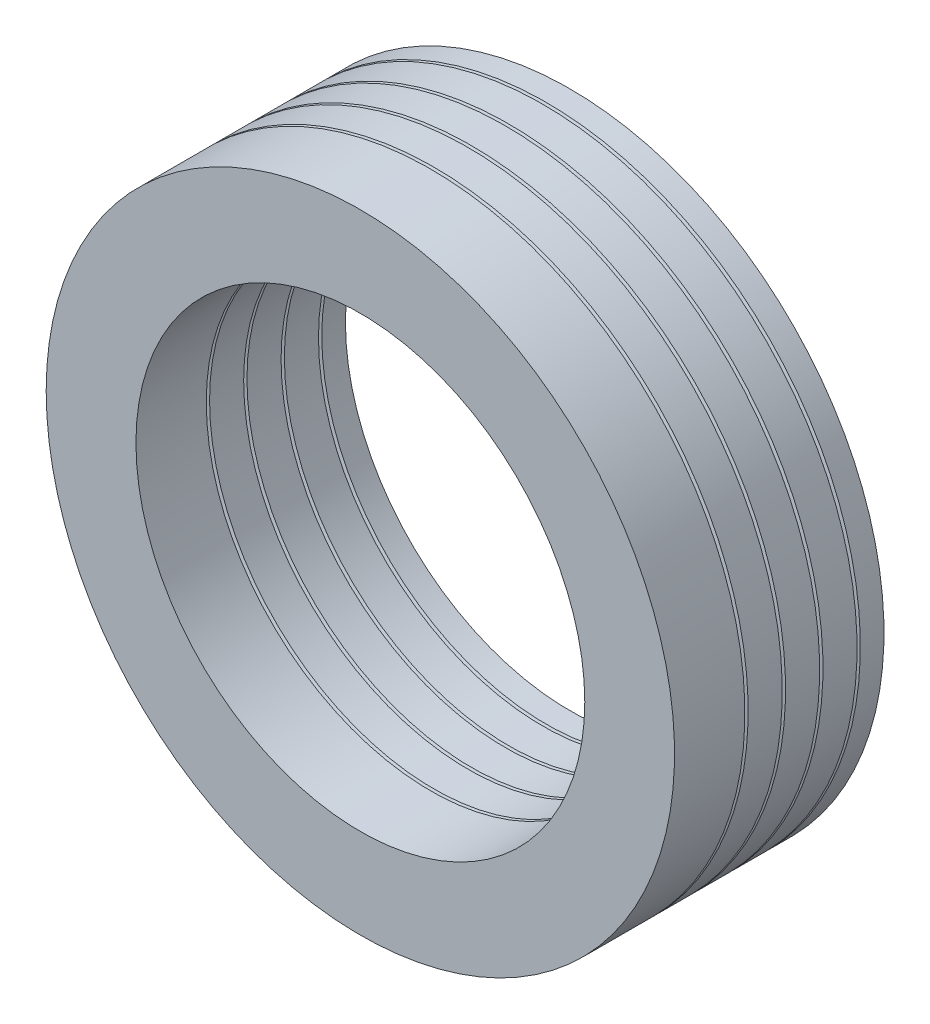
ISO-10303-21;
HEADER;
FILE_DESCRIPTION(('STEP AP214'),'2;1');
FILE_NAME('part.step','',(''),(''),'','','');
FILE_SCHEMA(('AUTOMOTIVE_DESIGN { 1 0 10303 214 1 1 1 1 }'));
ENDSEC;
DATA;
#1=APPLICATION_CONTEXT('core data for automotive mechanical design processes');
#2=APPLICATION_PROTOCOL_DEFINITION('international standard','automotive_design',2000,#1);
#3=PRODUCT_CONTEXT('',#1,'mechanical');
#4=PRODUCT('Part','Part','',(#3));
#5=PRODUCT_RELATED_PRODUCT_CATEGORY('part','',(#4));
#6=PRODUCT_DEFINITION_FORMATION('','',#4);
#7=PRODUCT_DEFINITION_CONTEXT('part definition',#1,'design');
#8=PRODUCT_DEFINITION('design','',#6,#7);
#9=PRODUCT_DEFINITION_SHAPE('','',#8);
#10=(LENGTH_UNIT() NAMED_UNIT(*) SI_UNIT(.MILLI.,.METRE.));
#11=(NAMED_UNIT(*) PLANE_ANGLE_UNIT() SI_UNIT($,.RADIAN.));
#12=(NAMED_UNIT(*) SI_UNIT($,.STERADIAN.) SOLID_ANGLE_UNIT());
#13=UNCERTAINTY_MEASURE_WITH_UNIT(LENGTH_MEASURE(1.E-05),#10,'distance_accuracy_value','');
#14=(GEOMETRIC_REPRESENTATION_CONTEXT(3) GLOBAL_UNCERTAINTY_ASSIGNED_CONTEXT((#13)) GLOBAL_UNIT_ASSIGNED_CONTEXT((#10,
#11,#12)) REPRESENTATION_CONTEXT('',''));
#15=CARTESIAN_POINT('',(0.,0.,0.));
#16=DIRECTION('',(0.,0.,1.));
#17=DIRECTION('',(1.,0.,0.));
#18=AXIS2_PLACEMENT_3D('',#15,#16,#17);
#19=CARTESIAN_POINT('',(0.,0.,-102.328960848673));
#20=DIRECTION('',(0.,0.,-1.));
#21=DIRECTION('',(-1.,0.,0.));
#22=AXIS2_PLACEMENT_3D('',#19,#20,#21);
#23=CYLINDRICAL_SURFACE('',#22,21.);
#24=CARTESIAN_POINT('',(0.,0.,-4.92479310203521));
#25=DIRECTION('',(0.,0.,-1.));
#26=DIRECTION('',(-1.,0.,0.));
#27=AXIS2_PLACEMENT_3D('',#24,#25,#26);
#28=CIRCLE('',#27,21.);
#29=CARTESIAN_POINT('',(-21.,0.,-4.92479310203521));
#30=VERTEX_POINT('',#29);
#31=EDGE_CURVE('E74',#30,#30,#28,.T.);
#32=ORIENTED_EDGE('',*,*,#31,.T.);
#33=EDGE_LOOP('',(#32));
#34=FACE_BOUND('',#33,.T.);
#35=CARTESIAN_POINT('',(0.,0.,-7.20479310203521));
#36=DIRECTION('',(0.,0.,-1.));
#37=DIRECTION('',(-1.,0.,0.));
#38=AXIS2_PLACEMENT_3D('',#35,#36,#37);
#39=CIRCLE('',#38,21.);
#40=CARTESIAN_POINT('',(-21.,0.,-7.20479310203521));
#41=VERTEX_POINT('',#40);
#42=EDGE_CURVE('E11',#41,#41,#39,.T.);
#43=ORIENTED_EDGE('',*,*,#42,.F.);
#44=EDGE_LOOP('',(#43));
#45=FACE_BOUND('',#44,.T.);
#46=ADVANCED_FACE('F43',(#34,#45),#23,.T.);
#47=CARTESIAN_POINT('',(0.,0.,-6.00108691411944));
#48=DIRECTION('',(0.,0.,-1.));
#49=DIRECTION('',(-1.,0.,0.));
#50=AXIS2_PLACEMENT_3D('',#47,#48,#49);
#51=CONICAL_SURFACE('',#50,18.5,1.12207217610716);
#52=ORIENTED_EDGE('',*,*,#42,.T.);
#53=EDGE_LOOP('',(#52));
#54=FACE_BOUND('',#53,.T.);
#55=CARTESIAN_POINT('',(0.,0.,-6.00108691411944));
#56=DIRECTION('',(0.,0.,-1.));
#57=DIRECTION('',(-1.,0.,0.));
#58=AXIS2_PLACEMENT_3D('',#55,#56,#57);
#59=CIRCLE('',#58,18.5);
#60=CARTESIAN_POINT('',(-18.5,0.,-6.00108691411944));
#61=VERTEX_POINT('',#60);
#62=EDGE_CURVE('E49',#61,#61,#59,.T.);
#63=ORIENTED_EDGE('',*,*,#62,.F.);
#64=EDGE_LOOP('',(#63));
#65=FACE_BOUND('',#64,.T.);
#66=ADVANCED_FACE('F92',(#54,#65),#51,.F.);
#67=CARTESIAN_POINT('',(0.,0.,-102.328960848673));
#68=DIRECTION('',(0.,0.,-1.));
#69=DIRECTION('',(-1.,0.,0.));
#70=AXIS2_PLACEMENT_3D('',#67,#68,#69);
#71=CYLINDRICAL_SURFACE('',#70,18.5);
#72=ORIENTED_EDGE('',*,*,#62,.T.);
#73=EDGE_LOOP('',(#72));
#74=FACE_BOUND('',#73,.T.);
#75=CARTESIAN_POINT('',(0.,0.,-5.60681945496049));
#76=DIRECTION('',(0.,0.,-1.));
#77=DIRECTION('',(-1.,0.,0.));
#78=AXIS2_PLACEMENT_3D('',#75,#76,#77);
#79=CIRCLE('',#78,18.5);
#80=CARTESIAN_POINT('',(-18.5,0.,-5.60681945496049));
#81=VERTEX_POINT('',#80);
#82=EDGE_CURVE('E53',#81,#81,#79,.T.);
#83=ORIENTED_EDGE('',*,*,#82,.F.);
#84=EDGE_LOOP('',(#83));
#85=FACE_BOUND('',#84,.T.);
#86=ADVANCED_FACE('F96',(#74,#85),#71,.F.);
#87=CARTESIAN_POINT('',(-18.5,0.,-5.60681945496048));
#88=DIRECTION('',(0.,0.,-1.));
#89=DIRECTION('',(-1.,0.,0.));
#90=AXIS2_PLACEMENT_3D('',#87,#88,#89);
#91=PLANE('',#90);
#92=ORIENTED_EDGE('',*,*,#82,.T.);
#93=EDGE_LOOP('',(#92));
#94=FACE_BOUND('',#93,.T.);
#95=CARTESIAN_POINT('',(0.,0.,-5.60681945496049));
#96=DIRECTION('',(0.,0.,-1.));
#97=DIRECTION('',(-1.,0.,0.));
#98=AXIS2_PLACEMENT_3D('',#95,#96,#97);
#99=CIRCLE('',#98,17.5);
#100=CARTESIAN_POINT('',(-17.5,0.,-5.60681945496049));
#101=VERTEX_POINT('',#100);
#102=EDGE_CURVE('E57',#101,#101,#99,.T.);
#103=ORIENTED_EDGE('',*,*,#102,.F.);
#104=EDGE_LOOP('',(#103));
#105=FACE_BOUND('',#104,.T.);
#106=ADVANCED_FACE('F100',(#94,#105),#91,.T.);
#107=CARTESIAN_POINT('',(0.,0.,-102.328960848673));
#108=DIRECTION('',(0.,0.,-1.));
#109=DIRECTION('',(-1.,0.,0.));
#110=AXIS2_PLACEMENT_3D('',#107,#108,#109);
#111=CYLINDRICAL_SURFACE('',#110,17.5);
#112=ORIENTED_EDGE('',*,*,#102,.T.);
#113=EDGE_LOOP('',(#112));
#114=FACE_BOUND('',#113,.T.);
#115=CARTESIAN_POINT('',(0.,0.,-6.00108691411944));
#116=DIRECTION('',(0.,0.,-1.));
#117=DIRECTION('',(-1.,0.,0.));
#118=AXIS2_PLACEMENT_3D('',#115,#116,#117);
#119=CIRCLE('',#118,17.5);
#120=CARTESIAN_POINT('',(-17.5,0.,-6.00108691411944));
#121=VERTEX_POINT('',#120);
#122=EDGE_CURVE('E62',#121,#121,#119,.T.);
#123=ORIENTED_EDGE('',*,*,#122,.F.);
#124=EDGE_LOOP('',(#123));
#125=FACE_BOUND('',#124,.T.);
#126=ADVANCED_FACE('F106',(#114,#125),#111,.T.);
#127=CARTESIAN_POINT('',(0.,0.,-7.20479310203521));
#128=DIRECTION('',(0.,0.,1.));
#129=DIRECTION('',(1.,0.,0.));
#130=AXIS2_PLACEMENT_3D('',#127,#128,#129);
#131=CONICAL_SURFACE('',#130,15.,1.12207217610716);
#132=ORIENTED_EDGE('',*,*,#122,.T.);
#133=EDGE_LOOP('',(#132));
#134=FACE_BOUND('',#133,.T.);
#135=CARTESIAN_POINT('',(0.,0.,-7.20479310203521));
#136=DIRECTION('',(0.,0.,-1.));
#137=DIRECTION('',(-1.,0.,0.));
#138=AXIS2_PLACEMENT_3D('',#135,#136,#137);
#139=CIRCLE('',#138,15.);
#140=CARTESIAN_POINT('',(-15.,0.,-7.20479310203521));
#141=VERTEX_POINT('',#140);
#142=EDGE_CURVE('E65',#141,#141,#139,.T.);
#143=ORIENTED_EDGE('',*,*,#142,.F.);
#144=EDGE_LOOP('',(#143));
#145=FACE_BOUND('',#144,.T.);
#146=ADVANCED_FACE('F110',(#134,#145),#131,.T.);
#147=CARTESIAN_POINT('',(0.,0.,-102.328960848673));
#148=DIRECTION('',(0.,0.,-1.));
#149=DIRECTION('',(-1.,0.,0.));
#150=AXIS2_PLACEMENT_3D('',#147,#148,#149);
#151=CYLINDRICAL_SURFACE('',#150,15.);
#152=ORIENTED_EDGE('',*,*,#142,.T.);
#153=EDGE_LOOP('',(#152));
#154=FACE_BOUND('',#153,.T.);
#155=CARTESIAN_POINT('',(0.,0.,-4.92479310203521));
#156=DIRECTION('',(0.,0.,-1.));
#157=DIRECTION('',(-1.,0.,0.));
#158=AXIS2_PLACEMENT_3D('',#155,#156,#157);
#159=CIRCLE('',#158,15.);
#160=CARTESIAN_POINT('',(-15.,0.,-4.92479310203521));
#161=VERTEX_POINT('',#160);
#162=EDGE_CURVE('E68',#161,#161,#159,.T.);
#163=ORIENTED_EDGE('',*,*,#162,.F.);
#164=EDGE_LOOP('',(#163));
#165=FACE_BOUND('',#164,.T.);
#166=ADVANCED_FACE('F88',(#154,#165),#151,.F.);
#167=CARTESIAN_POINT('',(0.,0.,-3.48034567653628));
#168=DIRECTION('',(0.,0.,1.));
#169=DIRECTION('',(1.,0.,0.));
#170=AXIS2_PLACEMENT_3D('',#167,#168,#169);
#171=CONICAL_SURFACE('',#170,18.,1.12207217610716);
#172=ORIENTED_EDGE('',*,*,#162,.T.);
#173=EDGE_LOOP('',(#172));
#174=FACE_BOUND('',#173,.T.);
#175=CARTESIAN_POINT('',(0.,0.,-3.48034567653628));
#176=DIRECTION('',(0.,0.,-1.));
#177=DIRECTION('',(-1.,0.,0.));
#178=AXIS2_PLACEMENT_3D('',#175,#176,#177);
#179=CIRCLE('',#178,18.);
#180=CARTESIAN_POINT('',(-18.,0.,-3.48034567653628));
#181=VERTEX_POINT('',#180);
#182=EDGE_CURVE('E71',#181,#181,#179,.T.);
#183=ORIENTED_EDGE('',*,*,#182,.F.);
#184=EDGE_LOOP('',(#183));
#185=FACE_BOUND('',#184,.T.);
#186=ADVANCED_FACE('F82',(#174,#185),#171,.F.);
#187=CARTESIAN_POINT('',(0.,0.,-4.92479310203521));
#188=DIRECTION('',(0.,0.,-1.));
#189=DIRECTION('',(-1.,0.,0.));
#190=AXIS2_PLACEMENT_3D('',#187,#188,#189);
#191=CONICAL_SURFACE('',#190,21.,1.12207217610716);
#192=ORIENTED_EDGE('',*,*,#182,.T.);
#193=EDGE_LOOP('',(#192));
#194=FACE_BOUND('',#193,.T.);
#195=ORIENTED_EDGE('',*,*,#31,.F.);
#196=EDGE_LOOP('',(#195));
#197=FACE_BOUND('',#196,.T.);
#198=ADVANCED_FACE('F80',(#194,#197),#191,.T.);
#199=CLOSED_SHELL('',(#46,#66,#86,#106,#126,#146,#166,#186,#198));
#200=MANIFOLD_SOLID_BREP('B2',#199);
#201=CARTESIAN_POINT('',(0.,0.,-102.328960848673));
#202=DIRECTION('',(0.,0.,-1.));
#203=DIRECTION('',(-1.,0.,0.));
#204=AXIS2_PLACEMENT_3D('',#201,#202,#203);
#205=CYLINDRICAL_SURFACE('',#204,21.);
#206=CARTESIAN_POINT('',(0.,0.,-7.42479310203521));
#207=DIRECTION('',(0.,0.,-1.));
#208=DIRECTION('',(-1.,0.,0.));
#209=AXIS2_PLACEMENT_3D('',#206,#207,#208);
#210=CIRCLE('',#209,21.);
#211=CARTESIAN_POINT('',(-21.,0.,-7.42479310203521));
#212=VERTEX_POINT('',#211);
#213=EDGE_CURVE('E218',#212,#212,#210,.T.);
#214=ORIENTED_EDGE('',*,*,#213,.T.);
#215=EDGE_LOOP('',(#214));
#216=FACE_BOUND('',#215,.T.);
#217=CARTESIAN_POINT('',(0.,0.,-9.70479310203522));
#218=DIRECTION('',(0.,0.,-1.));
#219=DIRECTION('',(-1.,0.,0.));
#220=AXIS2_PLACEMENT_3D('',#217,#218,#219);
#221=CIRCLE('',#220,21.);
#222=CARTESIAN_POINT('',(-21.,0.,-9.70479310203522));
#223=VERTEX_POINT('',#222);
#224=EDGE_CURVE('E42',#223,#223,#221,.T.);
#225=ORIENTED_EDGE('',*,*,#224,.F.);
#226=EDGE_LOOP('',(#225));
#227=FACE_BOUND('',#226,.T.);
#228=ADVANCED_FACE('F187',(#216,#227),#205,.T.);
#229=CARTESIAN_POINT('',(0.,0.,-8.50108691411944));
#230=DIRECTION('',(0.,0.,-1.));
#231=DIRECTION('',(-1.,0.,0.));
#232=AXIS2_PLACEMENT_3D('',#229,#230,#231);
#233=CONICAL_SURFACE('',#232,18.5,1.12207217610716);
#234=ORIENTED_EDGE('',*,*,#224,.T.);
#235=EDGE_LOOP('',(#234));
#236=FACE_BOUND('',#235,.T.);
#237=CARTESIAN_POINT('',(0.,0.,-8.50108691411944));
#238=DIRECTION('',(0.,0.,-1.));
#239=DIRECTION('',(-1.,0.,0.));
#240=AXIS2_PLACEMENT_3D('',#237,#238,#239);
#241=CIRCLE('',#240,18.5);
#242=CARTESIAN_POINT('',(-18.5,0.,-8.50108691411944));
#243=VERTEX_POINT('',#242);
#244=EDGE_CURVE('E193',#243,#243,#241,.T.);
#245=ORIENTED_EDGE('',*,*,#244,.F.);
#246=EDGE_LOOP('',(#245));
#247=FACE_BOUND('',#246,.T.);
#248=ADVANCED_FACE('F236',(#236,#247),#233,.F.);
#249=CARTESIAN_POINT('',(0.,0.,-102.328960848673));
#250=DIRECTION('',(0.,0.,-1.));
#251=DIRECTION('',(-1.,0.,0.));
#252=AXIS2_PLACEMENT_3D('',#249,#250,#251);
#253=CYLINDRICAL_SURFACE('',#252,18.5);
#254=ORIENTED_EDGE('',*,*,#244,.T.);
#255=EDGE_LOOP('',(#254));
#256=FACE_BOUND('',#255,.T.);
#257=CARTESIAN_POINT('',(0.,0.,-8.10681945496049));
#258=DIRECTION('',(0.,0.,-1.));
#259=DIRECTION('',(-1.,0.,0.));
#260=AXIS2_PLACEMENT_3D('',#257,#258,#259);
#261=CIRCLE('',#260,18.5);
#262=CARTESIAN_POINT('',(-18.5,0.,-8.10681945496049));
#263=VERTEX_POINT('',#262);
#264=EDGE_CURVE('E197',#263,#263,#261,.T.);
#265=ORIENTED_EDGE('',*,*,#264,.F.);
#266=EDGE_LOOP('',(#265));
#267=FACE_BOUND('',#266,.T.);
#268=ADVANCED_FACE('F240',(#256,#267),#253,.F.);
#269=CARTESIAN_POINT('',(-18.5,0.,-8.10681945496048));
#270=DIRECTION('',(0.,0.,-1.));
#271=DIRECTION('',(-1.,0.,0.));
#272=AXIS2_PLACEMENT_3D('',#269,#270,#271);
#273=PLANE('',#272);
#274=ORIENTED_EDGE('',*,*,#264,.T.);
#275=EDGE_LOOP('',(#274));
#276=FACE_BOUND('',#275,.T.);
#277=CARTESIAN_POINT('',(0.,0.,-8.10681945496049));
#278=DIRECTION('',(0.,0.,-1.));
#279=DIRECTION('',(-1.,0.,0.));
#280=AXIS2_PLACEMENT_3D('',#277,#278,#279);
#281=CIRCLE('',#280,17.5);
#282=CARTESIAN_POINT('',(-17.5,0.,-8.10681945496049));
#283=VERTEX_POINT('',#282);
#284=EDGE_CURVE('E201',#283,#283,#281,.T.);
#285=ORIENTED_EDGE('',*,*,#284,.F.);
#286=EDGE_LOOP('',(#285));
#287=FACE_BOUND('',#286,.T.);
#288=ADVANCED_FACE('F244',(#276,#287),#273,.T.);
#289=CARTESIAN_POINT('',(0.,0.,-102.328960848673));
#290=DIRECTION('',(0.,0.,-1.));
#291=DIRECTION('',(-1.,0.,0.));
#292=AXIS2_PLACEMENT_3D('',#289,#290,#291);
#293=CYLINDRICAL_SURFACE('',#292,17.5);
#294=ORIENTED_EDGE('',*,*,#284,.T.);
#295=EDGE_LOOP('',(#294));
#296=FACE_BOUND('',#295,.T.);
#297=CARTESIAN_POINT('',(0.,0.,-8.50108691411944));
#298=DIRECTION('',(0.,0.,-1.));
#299=DIRECTION('',(-1.,0.,0.));
#300=AXIS2_PLACEMENT_3D('',#297,#298,#299);
#301=CIRCLE('',#300,17.5);
#302=CARTESIAN_POINT('',(-17.5,0.,-8.50108691411944));
#303=VERTEX_POINT('',#302);
#304=EDGE_CURVE('E206',#303,#303,#301,.T.);
#305=ORIENTED_EDGE('',*,*,#304,.F.);
#306=EDGE_LOOP('',(#305));
#307=FACE_BOUND('',#306,.T.);
#308=ADVANCED_FACE('F250',(#296,#307),#293,.T.);
#309=CARTESIAN_POINT('',(0.,0.,-9.70479310203522));
#310=DIRECTION('',(0.,0.,1.));
#311=DIRECTION('',(1.,0.,0.));
#312=AXIS2_PLACEMENT_3D('',#309,#310,#311);
#313=CONICAL_SURFACE('',#312,15.,1.12207217610716);
#314=ORIENTED_EDGE('',*,*,#304,.T.);
#315=EDGE_LOOP('',(#314));
#316=FACE_BOUND('',#315,.T.);
#317=CARTESIAN_POINT('',(0.,0.,-9.70479310203522));
#318=DIRECTION('',(0.,0.,-1.));
#319=DIRECTION('',(-1.,0.,0.));
#320=AXIS2_PLACEMENT_3D('',#317,#318,#319);
#321=CIRCLE('',#320,15.);
#322=CARTESIAN_POINT('',(-15.,0.,-9.70479310203522));
#323=VERTEX_POINT('',#322);
#324=EDGE_CURVE('E209',#323,#323,#321,.T.);
#325=ORIENTED_EDGE('',*,*,#324,.F.);
#326=EDGE_LOOP('',(#325));
#327=FACE_BOUND('',#326,.T.);
#328=ADVANCED_FACE('F254',(#316,#327),#313,.T.);
#329=CARTESIAN_POINT('',(0.,0.,-102.328960848673));
#330=DIRECTION('',(0.,0.,-1.));
#331=DIRECTION('',(-1.,0.,0.));
#332=AXIS2_PLACEMENT_3D('',#329,#330,#331);
#333=CYLINDRICAL_SURFACE('',#332,15.);
#334=ORIENTED_EDGE('',*,*,#324,.T.);
#335=EDGE_LOOP('',(#334));
#336=FACE_BOUND('',#335,.T.);
#337=CARTESIAN_POINT('',(0.,0.,-7.42479310203521));
#338=DIRECTION('',(0.,0.,-1.));
#339=DIRECTION('',(-1.,0.,0.));
#340=AXIS2_PLACEMENT_3D('',#337,#338,#339);
#341=CIRCLE('',#340,15.);
#342=CARTESIAN_POINT('',(-15.,0.,-7.42479310203521));
#343=VERTEX_POINT('',#342);
#344=EDGE_CURVE('E212',#343,#343,#341,.T.);
#345=ORIENTED_EDGE('',*,*,#344,.F.);
#346=EDGE_LOOP('',(#345));
#347=FACE_BOUND('',#346,.T.);
#348=ADVANCED_FACE('F232',(#336,#347),#333,.F.);
#349=CARTESIAN_POINT('',(0.,0.,-5.98034567653628));
#350=DIRECTION('',(0.,0.,1.));
#351=DIRECTION('',(1.,0.,0.));
#352=AXIS2_PLACEMENT_3D('',#349,#350,#351);
#353=CONICAL_SURFACE('',#352,18.,1.12207217610716);
#354=ORIENTED_EDGE('',*,*,#344,.T.);
#355=EDGE_LOOP('',(#354));
#356=FACE_BOUND('',#355,.T.);
#357=CARTESIAN_POINT('',(0.,0.,-5.98034567653628));
#358=DIRECTION('',(0.,0.,-1.));
#359=DIRECTION('',(-1.,0.,0.));
#360=AXIS2_PLACEMENT_3D('',#357,#358,#359);
#361=CIRCLE('',#360,18.);
#362=CARTESIAN_POINT('',(-18.,0.,-5.98034567653628));
#363=VERTEX_POINT('',#362);
#364=EDGE_CURVE('E215',#363,#363,#361,.T.);
#365=ORIENTED_EDGE('',*,*,#364,.F.);
#366=EDGE_LOOP('',(#365));
#367=FACE_BOUND('',#366,.T.);
#368=ADVANCED_FACE('F226',(#356,#367),#353,.F.);
#369=CARTESIAN_POINT('',(0.,0.,-7.42479310203521));
#370=DIRECTION('',(0.,0.,-1.));
#371=DIRECTION('',(-1.,0.,0.));
#372=AXIS2_PLACEMENT_3D('',#369,#370,#371);
#373=CONICAL_SURFACE('',#372,21.,1.12207217610716);
#374=ORIENTED_EDGE('',*,*,#364,.T.);
#375=EDGE_LOOP('',(#374));
#376=FACE_BOUND('',#375,.T.);
#377=ORIENTED_EDGE('',*,*,#213,.F.);
#378=EDGE_LOOP('',(#377));
#379=FACE_BOUND('',#378,.T.);
#380=ADVANCED_FACE('F224',(#376,#379),#373,.T.);
#381=CLOSED_SHELL('',(#228,#248,#268,#288,#308,#328,#348,#368,#380));
#382=MANIFOLD_SOLID_BREP('B6',#381);
#383=CARTESIAN_POINT('',(0.,0.,-102.328960848673));
#384=DIRECTION('',(0.,0.,-1.));
#385=DIRECTION('',(-1.,0.,0.));
#386=AXIS2_PLACEMENT_3D('',#383,#384,#385);
#387=CYLINDRICAL_SURFACE('',#386,21.);
#388=CARTESIAN_POINT('',(0.,0.,-9.92479310203522));
#389=DIRECTION('',(0.,0.,-1.));
#390=DIRECTION('',(-1.,0.,0.));
#391=AXIS2_PLACEMENT_3D('',#388,#389,#390);
#392=CIRCLE('',#391,21.);
#393=CARTESIAN_POINT('',(-21.,0.,-9.92479310203522));
#394=VERTEX_POINT('',#393);
#395=EDGE_CURVE('E362',#394,#394,#392,.T.);
#396=ORIENTED_EDGE('',*,*,#395,.T.);
#397=EDGE_LOOP('',(#396));
#398=FACE_BOUND('',#397,.T.);
#399=CARTESIAN_POINT('',(0.,0.,-12.2047931020352));
#400=DIRECTION('',(0.,0.,-1.));
#401=DIRECTION('',(-1.,0.,0.));
#402=AXIS2_PLACEMENT_3D('',#399,#400,#401);
#403=CIRCLE('',#402,21.);
#404=CARTESIAN_POINT('',(-21.,0.,-12.2047931020352));
#405=VERTEX_POINT('',#404);
#406=EDGE_CURVE('E186',#405,#405,#403,.T.);
#407=ORIENTED_EDGE('',*,*,#406,.F.);
#408=EDGE_LOOP('',(#407));
#409=FACE_BOUND('',#408,.T.);
#410=ADVANCED_FACE('F331',(#398,#409),#387,.T.);
#411=CARTESIAN_POINT('',(0.,0.,-11.0010869141194));
#412=DIRECTION('',(0.,0.,-1.));
#413=DIRECTION('',(-1.,0.,0.));
#414=AXIS2_PLACEMENT_3D('',#411,#412,#413);
#415=CONICAL_SURFACE('',#414,18.5,1.12207217610716);
#416=ORIENTED_EDGE('',*,*,#406,.T.);
#417=EDGE_LOOP('',(#416));
#418=FACE_BOUND('',#417,.T.);
#419=CARTESIAN_POINT('',(0.,0.,-11.0010869141194));
#420=DIRECTION('',(0.,0.,-1.));
#421=DIRECTION('',(-1.,0.,0.));
#422=AXIS2_PLACEMENT_3D('',#419,#420,#421);
#423=CIRCLE('',#422,18.5);
#424=CARTESIAN_POINT('',(-18.5,0.,-11.0010869141194));
#425=VERTEX_POINT('',#424);
#426=EDGE_CURVE('E337',#425,#425,#423,.T.);
#427=ORIENTED_EDGE('',*,*,#426,.F.);
#428=EDGE_LOOP('',(#427));
#429=FACE_BOUND('',#428,.T.);
#430=ADVANCED_FACE('F380',(#418,#429),#415,.F.);
#431=CARTESIAN_POINT('',(0.,0.,-102.328960848673));
#432=DIRECTION('',(0.,0.,-1.));
#433=DIRECTION('',(-1.,0.,0.));
#434=AXIS2_PLACEMENT_3D('',#431,#432,#433);
#435=CYLINDRICAL_SURFACE('',#434,18.5);
#436=ORIENTED_EDGE('',*,*,#426,.T.);
#437=EDGE_LOOP('',(#436));
#438=FACE_BOUND('',#437,.T.);
#439=CARTESIAN_POINT('',(0.,0.,-10.6068194549605));
#440=DIRECTION('',(0.,0.,-1.));
#441=DIRECTION('',(-1.,0.,0.));
#442=AXIS2_PLACEMENT_3D('',#439,#440,#441);
#443=CIRCLE('',#442,18.5);
#444=CARTESIAN_POINT('',(-18.5,0.,-10.6068194549605));
#445=VERTEX_POINT('',#444);
#446=EDGE_CURVE('E341',#445,#445,#443,.T.);
#447=ORIENTED_EDGE('',*,*,#446,.F.);
#448=EDGE_LOOP('',(#447));
#449=FACE_BOUND('',#448,.T.);
#450=ADVANCED_FACE('F384',(#438,#449),#435,.F.);
#451=CARTESIAN_POINT('',(-18.5,0.,-10.6068194549605));
#452=DIRECTION('',(0.,0.,-1.));
#453=DIRECTION('',(-1.,0.,0.));
#454=AXIS2_PLACEMENT_3D('',#451,#452,#453);
#455=PLANE('',#454);
#456=ORIENTED_EDGE('',*,*,#446,.T.);
#457=EDGE_LOOP('',(#456));
#458=FACE_BOUND('',#457,.T.);
#459=CARTESIAN_POINT('',(0.,0.,-10.6068194549605));
#460=DIRECTION('',(0.,0.,-1.));
#461=DIRECTION('',(-1.,0.,0.));
#462=AXIS2_PLACEMENT_3D('',#459,#460,#461);
#463=CIRCLE('',#462,17.5);
#464=CARTESIAN_POINT('',(-17.5,0.,-10.6068194549605));
#465=VERTEX_POINT('',#464);
#466=EDGE_CURVE('E345',#465,#465,#463,.T.);
#467=ORIENTED_EDGE('',*,*,#466,.F.);
#468=EDGE_LOOP('',(#467));
#469=FACE_BOUND('',#468,.T.);
#470=ADVANCED_FACE('F388',(#458,#469),#455,.T.);
#471=CARTESIAN_POINT('',(0.,0.,-102.328960848673));
#472=DIRECTION('',(0.,0.,-1.));
#473=DIRECTION('',(-1.,0.,0.));
#474=AXIS2_PLACEMENT_3D('',#471,#472,#473);
#475=CYLINDRICAL_SURFACE('',#474,17.5);
#476=ORIENTED_EDGE('',*,*,#466,.T.);
#477=EDGE_LOOP('',(#476));
#478=FACE_BOUND('',#477,.T.);
#479=CARTESIAN_POINT('',(0.,0.,-11.0010869141194));
#480=DIRECTION('',(0.,0.,-1.));
#481=DIRECTION('',(-1.,0.,0.));
#482=AXIS2_PLACEMENT_3D('',#479,#480,#481);
#483=CIRCLE('',#482,17.5);
#484=CARTESIAN_POINT('',(-17.5,0.,-11.0010869141194));
#485=VERTEX_POINT('',#484);
#486=EDGE_CURVE('E350',#485,#485,#483,.T.);
#487=ORIENTED_EDGE('',*,*,#486,.F.);
#488=EDGE_LOOP('',(#487));
#489=FACE_BOUND('',#488,.T.);
#490=ADVANCED_FACE('F394',(#478,#489),#475,.T.);
#491=CARTESIAN_POINT('',(0.,0.,-12.2047931020352));
#492=DIRECTION('',(0.,0.,1.));
#493=DIRECTION('',(1.,0.,0.));
#494=AXIS2_PLACEMENT_3D('',#491,#492,#493);
#495=CONICAL_SURFACE('',#494,15.,1.12207217610717);
#496=ORIENTED_EDGE('',*,*,#486,.T.);
#497=EDGE_LOOP('',(#496));
#498=FACE_BOUND('',#497,.T.);
#499=CARTESIAN_POINT('',(0.,0.,-12.2047931020352));
#500=DIRECTION('',(0.,0.,-1.));
#501=DIRECTION('',(-1.,0.,0.));
#502=AXIS2_PLACEMENT_3D('',#499,#500,#501);
#503=CIRCLE('',#502,15.);
#504=CARTESIAN_POINT('',(-15.,0.,-12.2047931020352));
#505=VERTEX_POINT('',#504);
#506=EDGE_CURVE('E353',#505,#505,#503,.T.);
#507=ORIENTED_EDGE('',*,*,#506,.F.);
#508=EDGE_LOOP('',(#507));
#509=FACE_BOUND('',#508,.T.);
#510=ADVANCED_FACE('F398',(#498,#509),#495,.T.);
#511=CARTESIAN_POINT('',(0.,0.,-102.328960848673));
#512=DIRECTION('',(0.,0.,-1.));
#513=DIRECTION('',(-1.,0.,0.));
#514=AXIS2_PLACEMENT_3D('',#511,#512,#513);
#515=CYLINDRICAL_SURFACE('',#514,15.);
#516=ORIENTED_EDGE('',*,*,#506,.T.);
#517=EDGE_LOOP('',(#516));
#518=FACE_BOUND('',#517,.T.);
#519=CARTESIAN_POINT('',(0.,0.,-9.92479310203522));
#520=DIRECTION('',(0.,0.,-1.));
#521=DIRECTION('',(-1.,0.,0.));
#522=AXIS2_PLACEMENT_3D('',#519,#520,#521);
#523=CIRCLE('',#522,15.);
#524=CARTESIAN_POINT('',(-15.,0.,-9.92479310203522));
#525=VERTEX_POINT('',#524);
#526=EDGE_CURVE('E356',#525,#525,#523,.T.);
#527=ORIENTED_EDGE('',*,*,#526,.F.);
#528=EDGE_LOOP('',(#527));
#529=FACE_BOUND('',#528,.T.);
#530=ADVANCED_FACE('F376',(#518,#529),#515,.F.);
#531=CARTESIAN_POINT('',(0.,0.,-8.48034567653629));
#532=DIRECTION('',(0.,0.,1.));
#533=DIRECTION('',(1.,0.,0.));
#534=AXIS2_PLACEMENT_3D('',#531,#532,#533);
#535=CONICAL_SURFACE('',#534,18.,1.12207217610716);
#536=ORIENTED_EDGE('',*,*,#526,.T.);
#537=EDGE_LOOP('',(#536));
#538=FACE_BOUND('',#537,.T.);
#539=CARTESIAN_POINT('',(0.,0.,-8.48034567653629));
#540=DIRECTION('',(0.,0.,-1.));
#541=DIRECTION('',(-1.,0.,0.));
#542=AXIS2_PLACEMENT_3D('',#539,#540,#541);
#543=CIRCLE('',#542,18.);
#544=CARTESIAN_POINT('',(-18.,0.,-8.48034567653629));
#545=VERTEX_POINT('',#544);
#546=EDGE_CURVE('E359',#545,#545,#543,.T.);
#547=ORIENTED_EDGE('',*,*,#546,.F.);
#548=EDGE_LOOP('',(#547));
#549=FACE_BOUND('',#548,.T.);
#550=ADVANCED_FACE('F370',(#538,#549),#535,.F.);
#551=CARTESIAN_POINT('',(0.,0.,-9.92479310203522));
#552=DIRECTION('',(0.,0.,-1.));
#553=DIRECTION('',(-1.,0.,0.));
#554=AXIS2_PLACEMENT_3D('',#551,#552,#553);
#555=CONICAL_SURFACE('',#554,21.,1.12207217610716);
#556=ORIENTED_EDGE('',*,*,#546,.T.);
#557=EDGE_LOOP('',(#556));
#558=FACE_BOUND('',#557,.T.);
#559=ORIENTED_EDGE('',*,*,#395,.F.);
#560=EDGE_LOOP('',(#559));
#561=FACE_BOUND('',#560,.T.);
#562=ADVANCED_FACE('F368',(#558,#561),#555,.T.);
#563=CLOSED_SHELL('',(#410,#430,#450,#470,#490,#510,#530,#550,#562));
#564=MANIFOLD_SOLID_BREP('B37',#563);
#565=CARTESIAN_POINT('',(0.,0.,-102.328960848673));
#566=DIRECTION('',(0.,0.,-1.));
#567=DIRECTION('',(-1.,0.,0.));
#568=AXIS2_PLACEMENT_3D('',#565,#566,#567);
#569=CYLINDRICAL_SURFACE('',#568,21.);
#570=CARTESIAN_POINT('',(0.,0.,-12.4247931020352));
#571=DIRECTION('',(0.,0.,-1.));
#572=DIRECTION('',(-1.,0.,0.));
#573=AXIS2_PLACEMENT_3D('',#570,#571,#572);
#574=CIRCLE('',#573,21.);
#575=CARTESIAN_POINT('',(-21.,0.,-12.4247931020352));
#576=VERTEX_POINT('',#575);
#577=EDGE_CURVE('E330',#576,#576,#574,.T.);
#578=ORIENTED_EDGE('',*,*,#577,.T.);
#579=EDGE_LOOP('',(#578));
#580=FACE_BOUND('',#579,.T.);
#581=CARTESIAN_POINT('',(0.,0.,-14.0047931020352));
#582=DIRECTION('',(0.,0.,-1.));
#583=DIRECTION('',(-1.,0.,0.));
#584=AXIS2_PLACEMENT_3D('',#581,#582,#583);
#585=CIRCLE('',#584,21.);
#586=CARTESIAN_POINT('',(-21.,0.,-14.0047931020352));
#587=VERTEX_POINT('',#586);
#588=EDGE_CURVE('E505',#587,#587,#585,.T.);
#589=ORIENTED_EDGE('',*,*,#588,.F.);
#590=EDGE_LOOP('',(#589));
#591=FACE_BOUND('',#590,.T.);
#592=ADVANCED_FACE('F474',(#580,#591),#569,.T.);
#593=CARTESIAN_POINT('',(0.,0.,-12.4247931020352));
#594=DIRECTION('',(0.,0.,-1.));
#595=DIRECTION('',(-1.,0.,0.));
#596=AXIS2_PLACEMENT_3D('',#593,#594,#595);
#597=CONICAL_SURFACE('',#596,21.,1.12207217610716);
#598=CARTESIAN_POINT('',(0.,0.,-10.9803456765363));
#599=DIRECTION('',(0.,0.,-1.));
#600=DIRECTION('',(-1.,0.,0.));
#601=AXIS2_PLACEMENT_3D('',#598,#599,#600);
#602=CIRCLE('',#601,18.);
#603=CARTESIAN_POINT('',(-18.,0.,-10.9803456765363));
#604=VERTEX_POINT('',#603);
#605=EDGE_CURVE('E480',#604,#604,#602,.T.);
#606=ORIENTED_EDGE('',*,*,#605,.T.);
#607=EDGE_LOOP('',(#606));
#608=FACE_BOUND('',#607,.T.);
#609=ORIENTED_EDGE('',*,*,#577,.F.);
#610=EDGE_LOOP('',(#609));
#611=FACE_BOUND('',#610,.T.);
#612=ADVANCED_FACE('F513',(#608,#611),#597,.T.);
#613=CARTESIAN_POINT('',(0.,0.,-10.9803456765363));
#614=DIRECTION('',(0.,0.,1.));
#615=DIRECTION('',(1.,0.,0.));
#616=AXIS2_PLACEMENT_3D('',#613,#614,#615);
#617=CONICAL_SURFACE('',#616,18.,1.12207217610716);
#618=CARTESIAN_POINT('',(0.,0.,-12.4247931020352));
#619=DIRECTION('',(0.,0.,-1.));
#620=DIRECTION('',(-1.,0.,0.));
#621=AXIS2_PLACEMENT_3D('',#618,#619,#620);
#622=CIRCLE('',#621,15.);
#623=CARTESIAN_POINT('',(-15.,0.,-12.4247931020352));
#624=VERTEX_POINT('',#623);
#625=EDGE_CURVE('E484',#624,#624,#622,.T.);
#626=ORIENTED_EDGE('',*,*,#625,.T.);
#627=EDGE_LOOP('',(#626));
#628=FACE_BOUND('',#627,.T.);
#629=ORIENTED_EDGE('',*,*,#605,.F.);
#630=EDGE_LOOP('',(#629));
#631=FACE_BOUND('',#630,.T.);
#632=ADVANCED_FACE('F517',(#628,#631),#617,.F.);
#633=CARTESIAN_POINT('',(0.,0.,-102.328960848673));
#634=DIRECTION('',(0.,0.,-1.));
#635=DIRECTION('',(-1.,0.,0.));
#636=AXIS2_PLACEMENT_3D('',#633,#634,#635);
#637=CYLINDRICAL_SURFACE('',#636,15.);
#638=CARTESIAN_POINT('',(0.,0.,-14.0047931020352));
#639=DIRECTION('',(0.,0.,-1.));
#640=DIRECTION('',(-1.,0.,0.));
#641=AXIS2_PLACEMENT_3D('',#638,#639,#640);
#642=CIRCLE('',#641,15.);
#643=CARTESIAN_POINT('',(-15.,0.,-14.0047931020352));
#644=VERTEX_POINT('',#643);
#645=EDGE_CURVE('E488',#644,#644,#642,.T.);
#646=ORIENTED_EDGE('',*,*,#645,.T.);
#647=EDGE_LOOP('',(#646));
#648=FACE_BOUND('',#647,.T.);
#649=ORIENTED_EDGE('',*,*,#625,.F.);
#650=EDGE_LOOP('',(#649));
#651=FACE_BOUND('',#650,.T.);
#652=ADVANCED_FACE('F521',(#648,#651),#637,.F.);
#653=CARTESIAN_POINT('',(-15.,0.,-14.0047931020352));
#654=DIRECTION('',(0.,0.,-1.));
#655=DIRECTION('',(-1.,0.,0.));
#656=AXIS2_PLACEMENT_3D('',#653,#654,#655);
#657=PLANE('',#656);
#658=CARTESIAN_POINT('',(0.,0.,-14.0047931020352));
#659=DIRECTION('',(0.,0.,-1.));
#660=DIRECTION('',(-1.,0.,0.));
#661=AXIS2_PLACEMENT_3D('',#658,#659,#660);
#662=CIRCLE('',#661,17.5);
#663=CARTESIAN_POINT('',(-17.5,0.,-14.0047931020352));
#664=VERTEX_POINT('',#663);
#665=EDGE_CURVE('E493',#664,#664,#662,.T.);
#666=ORIENTED_EDGE('',*,*,#665,.T.);
#667=EDGE_LOOP('',(#666));
#668=FACE_BOUND('',#667,.T.);
#669=ORIENTED_EDGE('',*,*,#645,.F.);
#670=EDGE_LOOP('',(#669));
#671=FACE_BOUND('',#670,.T.);
#672=ADVANCED_FACE('F528',(#668,#671),#657,.T.);
#673=CARTESIAN_POINT('',(0.,0.,-102.328960848673));
#674=DIRECTION('',(0.,0.,-1.));
#675=DIRECTION('',(-1.,0.,0.));
#676=AXIS2_PLACEMENT_3D('',#673,#674,#675);
#677=CYLINDRICAL_SURFACE('',#676,17.5);
#678=CARTESIAN_POINT('',(0.,0.,-13.6147931020352));
#679=DIRECTION('',(0.,0.,-1.));
#680=DIRECTION('',(-1.,0.,0.));
#681=AXIS2_PLACEMENT_3D('',#678,#679,#680);
#682=CIRCLE('',#681,17.5);
#683=CARTESIAN_POINT('',(-17.5,0.,-13.6147931020352));
#684=VERTEX_POINT('',#683);
#685=EDGE_CURVE('E496',#684,#684,#682,.T.);
#686=ORIENTED_EDGE('',*,*,#685,.T.);
#687=EDGE_LOOP('',(#686));
#688=FACE_BOUND('',#687,.T.);
#689=ORIENTED_EDGE('',*,*,#665,.F.);
#690=EDGE_LOOP('',(#689));
#691=FACE_BOUND('',#690,.T.);
#692=ADVANCED_FACE('F532',(#688,#691),#677,.T.);
#693=CARTESIAN_POINT('',(-18.5,0.,-13.6147931020352));
#694=DIRECTION('',(0.,0.,-1.));
#695=DIRECTION('',(-1.,0.,0.));
#696=AXIS2_PLACEMENT_3D('',#693,#694,#695);
#697=PLANE('',#696);
#698=CARTESIAN_POINT('',(0.,0.,-13.6147931020352));
#699=DIRECTION('',(0.,0.,-1.));
#700=DIRECTION('',(-1.,0.,0.));
#701=AXIS2_PLACEMENT_3D('',#698,#699,#700);
#702=CIRCLE('',#701,18.5);
#703=CARTESIAN_POINT('',(-18.5,0.,-13.6147931020352));
#704=VERTEX_POINT('',#703);
#705=EDGE_CURVE('E499',#704,#704,#702,.T.);
#706=ORIENTED_EDGE('',*,*,#705,.T.);
#707=EDGE_LOOP('',(#706));
#708=FACE_BOUND('',#707,.T.);
#709=ORIENTED_EDGE('',*,*,#685,.F.);
#710=EDGE_LOOP('',(#709));
#711=FACE_BOUND('',#710,.T.);
#712=ADVANCED_FACE('F536',(#708,#711),#697,.T.);
#713=CARTESIAN_POINT('',(0.,0.,-102.328960848673));
#714=DIRECTION('',(0.,0.,-1.));
#715=DIRECTION('',(-1.,0.,0.));
#716=AXIS2_PLACEMENT_3D('',#713,#714,#715);
#717=CYLINDRICAL_SURFACE('',#716,18.5);
#718=CARTESIAN_POINT('',(0.,0.,-14.0047931020352));
#719=DIRECTION('',(0.,0.,-1.));
#720=DIRECTION('',(-1.,0.,0.));
#721=AXIS2_PLACEMENT_3D('',#718,#719,#720);
#722=CIRCLE('',#721,18.5);
#723=CARTESIAN_POINT('',(-18.5,0.,-14.0047931020352));
#724=VERTEX_POINT('',#723);
#725=EDGE_CURVE('E502',#724,#724,#722,.T.);
#726=ORIENTED_EDGE('',*,*,#725,.T.);
#727=EDGE_LOOP('',(#726));
#728=FACE_BOUND('',#727,.T.);
#729=ORIENTED_EDGE('',*,*,#705,.F.);
#730=EDGE_LOOP('',(#729));
#731=FACE_BOUND('',#730,.T.);
#732=ADVANCED_FACE('F540',(#728,#731),#717,.F.);
#733=CARTESIAN_POINT('',(-18.5,0.,-14.0047931020352));
#734=DIRECTION('',(0.,0.,-1.));
#735=DIRECTION('',(-1.,0.,0.));
#736=AXIS2_PLACEMENT_3D('',#733,#734,#735);
#737=PLANE('',#736);
#738=ORIENTED_EDGE('',*,*,#588,.T.);
#739=EDGE_LOOP('',(#738));
#740=FACE_BOUND('',#739,.T.);
#741=ORIENTED_EDGE('',*,*,#725,.F.);
#742=EDGE_LOOP('',(#741));
#743=FACE_BOUND('',#742,.T.);
#744=ADVANCED_FACE('F509',(#740,#743),#737,.T.);
#745=CLOSED_SHELL('',(#592,#612,#632,#652,#672,#692,#712,#732,#744));
#746=MANIFOLD_SOLID_BREP('B181',#745);
#747=CARTESIAN_POINT('',(0.,0.,-102.328960848673));
#748=DIRECTION('',(0.,0.,-1.));
#749=DIRECTION('',(-1.,0.,0.));
#750=AXIS2_PLACEMENT_3D('',#747,#748,#749);
#751=CYLINDRICAL_SURFACE('',#750,15.);
#752=CARTESIAN_POINT('',(0.,0.,-4.70479310203521));
#753=DIRECTION('',(0.,0.,-1.));
#754=DIRECTION('',(-1.,0.,0.));
#755=AXIS2_PLACEMENT_3D('',#752,#753,#754);
#756=CIRCLE('',#755,15.);
#757=CARTESIAN_POINT('',(-15.,0.,-4.70479310203521));
#758=VERTEX_POINT('',#757);
#759=EDGE_CURVE('E638',#758,#758,#756,.T.);
#760=ORIENTED_EDGE('',*,*,#759,.T.);
#761=EDGE_LOOP('',(#760));
#762=FACE_BOUND('',#761,.T.);
#763=CARTESIAN_POINT('',(0.,0.,-0.00479310203521655));
#764=DIRECTION('',(0.,0.,-1.));
#765=DIRECTION('',(-1.,0.,0.));
#766=AXIS2_PLACEMENT_3D('',#763,#764,#765);
#767=CIRCLE('',#766,15.);
#768=CARTESIAN_POINT('',(-15.,0.,-0.00479310203521655));
#769=VERTEX_POINT('',#768);
#770=EDGE_CURVE('E473',#769,#769,#767,.T.);
#771=ORIENTED_EDGE('',*,*,#770,.F.);
#772=EDGE_LOOP('',(#771));
#773=FACE_BOUND('',#772,.T.);
#774=ADVANCED_FACE('F610',(#762,#773),#751,.F.);
#775=CARTESIAN_POINT('',(-15.,0.,-0.00479310203521171));
#776=DIRECTION('',(0.,0.,1.));
#777=DIRECTION('',(1.,0.,0.));
#778=AXIS2_PLACEMENT_3D('',#775,#776,#777);
#779=PLANE('',#778);
#780=ORIENTED_EDGE('',*,*,#770,.T.);
#781=EDGE_LOOP('',(#780));
#782=FACE_BOUND('',#781,.T.);
#783=CARTESIAN_POINT('',(0.,0.,-0.00479310203521655));
#784=DIRECTION('',(0.,0.,-1.));
#785=DIRECTION('',(-1.,0.,0.));
#786=AXIS2_PLACEMENT_3D('',#783,#784,#785);
#787=CIRCLE('',#786,21.);
#788=CARTESIAN_POINT('',(-21.,0.,-0.00479310203521655));
#789=VERTEX_POINT('',#788);
#790=EDGE_CURVE('E616',#789,#789,#787,.T.);
#791=ORIENTED_EDGE('',*,*,#790,.F.);
#792=EDGE_LOOP('',(#791));
#793=FACE_BOUND('',#792,.T.);
#794=ADVANCED_FACE('F656',(#782,#793),#779,.T.);
#795=CARTESIAN_POINT('',(0.,0.,-102.328960848673));
#796=DIRECTION('',(0.,0.,-1.));
#797=DIRECTION('',(-1.,0.,0.));
#798=AXIS2_PLACEMENT_3D('',#795,#796,#797);
#799=CYLINDRICAL_SURFACE('',#798,21.);
#800=ORIENTED_EDGE('',*,*,#790,.T.);
#801=EDGE_LOOP('',(#800));
#802=FACE_BOUND('',#801,.T.);
#803=CARTESIAN_POINT('',(0.,0.,-4.70479310203521));
#804=DIRECTION('',(0.,0.,-1.));
#805=DIRECTION('',(-1.,0.,0.));
#806=AXIS2_PLACEMENT_3D('',#803,#804,#805);
#807=CIRCLE('',#806,21.);
#808=CARTESIAN_POINT('',(-21.,0.,-4.70479310203521));
#809=VERTEX_POINT('',#808);
#810=EDGE_CURVE('E620',#809,#809,#807,.T.);
#811=ORIENTED_EDGE('',*,*,#810,.F.);
#812=EDGE_LOOP('',(#811));
#813=FACE_BOUND('',#812,.T.);
#814=ADVANCED_FACE('F660',(#802,#813),#799,.T.);
#815=CARTESIAN_POINT('',(0.,0.,-3.50108691411943));
#816=DIRECTION('',(0.,0.,-1.));
#817=DIRECTION('',(-1.,0.,0.));
#818=AXIS2_PLACEMENT_3D('',#815,#816,#817);
#819=CONICAL_SURFACE('',#818,18.5,1.12207217610716);
#820=ORIENTED_EDGE('',*,*,#810,.T.);
#821=EDGE_LOOP('',(#820));
#822=FACE_BOUND('',#821,.T.);
#823=CARTESIAN_POINT('',(0.,0.,-3.50108691411943));
#824=DIRECTION('',(0.,0.,-1.));
#825=DIRECTION('',(-1.,0.,0.));
#826=AXIS2_PLACEMENT_3D('',#823,#824,#825);
#827=CIRCLE('',#826,18.5);
#828=CARTESIAN_POINT('',(-18.5,0.,-3.50108691411943));
#829=VERTEX_POINT('',#828);
#830=EDGE_CURVE('E624',#829,#829,#827,.T.);
#831=ORIENTED_EDGE('',*,*,#830,.F.);
#832=EDGE_LOOP('',(#831));
#833=FACE_BOUND('',#832,.T.);
#834=ADVANCED_FACE('F664',(#822,#833),#819,.F.);
#835=CARTESIAN_POINT('',(0.,0.,-102.328960848673));
#836=DIRECTION('',(0.,0.,-1.));
#837=DIRECTION('',(-1.,0.,0.));
#838=AXIS2_PLACEMENT_3D('',#835,#836,#837);
#839=CYLINDRICAL_SURFACE('',#838,18.5);
#840=ORIENTED_EDGE('',*,*,#830,.T.);
#841=EDGE_LOOP('',(#840));
#842=FACE_BOUND('',#841,.T.);
#843=CARTESIAN_POINT('',(0.,0.,-3.10681945496048));
#844=DIRECTION('',(0.,0.,-1.));
#845=DIRECTION('',(-1.,0.,0.));
#846=AXIS2_PLACEMENT_3D('',#843,#844,#845);
#847=CIRCLE('',#846,18.5);
#848=CARTESIAN_POINT('',(-18.5,0.,-3.10681945496048));
#849=VERTEX_POINT('',#848);
#850=EDGE_CURVE('E629',#849,#849,#847,.T.);
#851=ORIENTED_EDGE('',*,*,#850,.F.);
#852=EDGE_LOOP('',(#851));
#853=FACE_BOUND('',#852,.T.);
#854=ADVANCED_FACE('F670',(#842,#853),#839,.F.);
#855=CARTESIAN_POINT('',(-18.5,0.,-3.10681945496048));
#856=DIRECTION('',(0.,0.,-1.));
#857=DIRECTION('',(-1.,0.,0.));
#858=AXIS2_PLACEMENT_3D('',#855,#856,#857);
#859=PLANE('',#858);
#860=ORIENTED_EDGE('',*,*,#850,.T.);
#861=EDGE_LOOP('',(#860));
#862=FACE_BOUND('',#861,.T.);
#863=CARTESIAN_POINT('',(0.,0.,-3.10681945496048));
#864=DIRECTION('',(0.,0.,-1.));
#865=DIRECTION('',(-1.,0.,0.));
#866=AXIS2_PLACEMENT_3D('',#863,#864,#865);
#867=CIRCLE('',#866,17.5);
#868=CARTESIAN_POINT('',(-17.5,0.,-3.10681945496048));
#869=VERTEX_POINT('',#868);
#870=EDGE_CURVE('E632',#869,#869,#867,.T.);
#871=ORIENTED_EDGE('',*,*,#870,.F.);
#872=EDGE_LOOP('',(#871));
#873=FACE_BOUND('',#872,.T.);
#874=ADVANCED_FACE('F652',(#862,#873),#859,.T.);
#875=CARTESIAN_POINT('',(0.,0.,-102.328960848673));
#876=DIRECTION('',(0.,0.,-1.));
#877=DIRECTION('',(-1.,0.,0.));
#878=AXIS2_PLACEMENT_3D('',#875,#876,#877);
#879=CYLINDRICAL_SURFACE('',#878,17.5);
#880=ORIENTED_EDGE('',*,*,#870,.T.);
#881=EDGE_LOOP('',(#880));
#882=FACE_BOUND('',#881,.T.);
#883=CARTESIAN_POINT('',(0.,0.,-3.50108691411943));
#884=DIRECTION('',(0.,0.,-1.));
#885=DIRECTION('',(-1.,0.,0.));
#886=AXIS2_PLACEMENT_3D('',#883,#884,#885);
#887=CIRCLE('',#886,17.5);
#888=CARTESIAN_POINT('',(-17.5,0.,-3.50108691411943));
#889=VERTEX_POINT('',#888);
#890=EDGE_CURVE('E635',#889,#889,#887,.T.);
#891=ORIENTED_EDGE('',*,*,#890,.F.);
#892=EDGE_LOOP('',(#891));
#893=FACE_BOUND('',#892,.T.);
#894=ADVANCED_FACE('F646',(#882,#893),#879,.T.);
#895=CARTESIAN_POINT('',(0.,0.,-4.70479310203521));
#896=DIRECTION('',(0.,0.,1.));
#897=DIRECTION('',(1.,0.,0.));
#898=AXIS2_PLACEMENT_3D('',#895,#896,#897);
#899=CONICAL_SURFACE('',#898,15.,1.12207217610716);
#900=ORIENTED_EDGE('',*,*,#890,.T.);
#901=EDGE_LOOP('',(#900));
#902=FACE_BOUND('',#901,.T.);
#903=ORIENTED_EDGE('',*,*,#759,.F.);
#904=EDGE_LOOP('',(#903));
#905=FACE_BOUND('',#904,.T.);
#906=ADVANCED_FACE('F644',(#902,#905),#899,.T.);
#907=CLOSED_SHELL('',(#774,#794,#814,#834,#854,#874,#894,#906));
#908=MANIFOLD_SOLID_BREP('B325',#907);
#909=ADVANCED_BREP_SHAPE_REPRESENTATION('',(#18,#200,#382,#564,#746,#908),#14);
#910=SHAPE_DEFINITION_REPRESENTATION(#9,#909);
ENDSEC;
END-ISO-10303-21;
